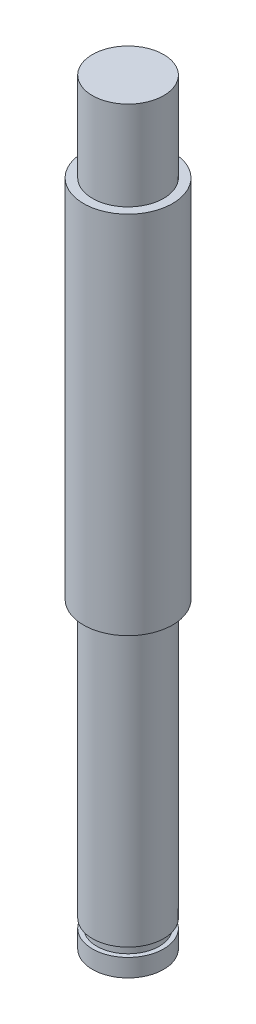
ISO-10303-21;
HEADER;
FILE_DESCRIPTION(('STEP AP214'),'2;1');
FILE_NAME('part.step','',(''),(''),'','','');
FILE_SCHEMA(('AUTOMOTIVE_DESIGN { 1 0 10303 214 1 1 1 1 }'));
ENDSEC;
DATA;
#1=APPLICATION_CONTEXT('core data for automotive mechanical design processes');
#2=APPLICATION_PROTOCOL_DEFINITION('international standard','automotive_design',2000,#1);
#3=PRODUCT_CONTEXT('',#1,'mechanical');
#4=PRODUCT('Part','Part','',(#3));
#5=PRODUCT_RELATED_PRODUCT_CATEGORY('part','',(#4));
#6=PRODUCT_DEFINITION_FORMATION('','',#4);
#7=PRODUCT_DEFINITION_CONTEXT('part definition',#1,'design');
#8=PRODUCT_DEFINITION('design','',#6,#7);
#9=PRODUCT_DEFINITION_SHAPE('','',#8);
#10=(LENGTH_UNIT() NAMED_UNIT(*) SI_UNIT(.MILLI.,.METRE.));
#11=(NAMED_UNIT(*) PLANE_ANGLE_UNIT() SI_UNIT($,.RADIAN.));
#12=(NAMED_UNIT(*) SI_UNIT($,.STERADIAN.) SOLID_ANGLE_UNIT());
#13=UNCERTAINTY_MEASURE_WITH_UNIT(LENGTH_MEASURE(1.E-05),#10,'distance_accuracy_value','');
#14=(GEOMETRIC_REPRESENTATION_CONTEXT(3) GLOBAL_UNCERTAINTY_ASSIGNED_CONTEXT((#13)) GLOBAL_UNIT_ASSIGNED_CONTEXT((#10,
#11,#12)) REPRESENTATION_CONTEXT('',''));
#15=CARTESIAN_POINT('',(0.,0.,0.));
#16=DIRECTION('',(0.,0.,1.));
#17=DIRECTION('',(1.,0.,0.));
#18=AXIS2_PLACEMENT_3D('',#15,#16,#17);
#19=CARTESIAN_POINT('',(0.,-34.,0.));
#20=DIRECTION('',(0.,-1.,0.));
#21=DIRECTION('',(0.,0.,-1.));
#22=AXIS2_PLACEMENT_3D('',#19,#20,#21);
#23=PLANE('',#22);
#24=CARTESIAN_POINT('',(0.,-34.,0.));
#25=DIRECTION('',(0.,-1.,0.));
#26=DIRECTION('',(0.,0.,-1.));
#27=AXIS2_PLACEMENT_3D('',#24,#25,#26);
#28=CIRCLE('',#27,4.);
#29=CARTESIAN_POINT('',(0.,-34.,-4.));
#30=VERTEX_POINT('',#29);
#31=EDGE_CURVE('E18',#30,#30,#28,.F.);
#32=ORIENTED_EDGE('',*,*,#31,.F.);
#33=EDGE_LOOP('',(#32));
#34=FACE_BOUND('',#33,.T.);
#35=ADVANCED_FACE('F15',(#34),#23,.T.);
#36=CARTESIAN_POINT('',(0.,0.,0.));
#37=DIRECTION('',(0.,-1.,0.));
#38=DIRECTION('',(0.,0.,-1.));
#39=AXIS2_PLACEMENT_3D('',#36,#37,#38);
#40=CYLINDRICAL_SURFACE('',#39,4.);
#41=ORIENTED_EDGE('',*,*,#31,.T.);
#42=EDGE_LOOP('',(#41));
#43=FACE_BOUND('',#42,.T.);
#44=CARTESIAN_POINT('',(0.,-32.,0.));
#45=DIRECTION('',(0.,-1.,0.));
#46=DIRECTION('',(0.,0.,-1.));
#47=AXIS2_PLACEMENT_3D('',#44,#45,#46);
#48=CIRCLE('',#47,4.);
#49=CARTESIAN_POINT('',(0.,-32.,-4.));
#50=VERTEX_POINT('',#49);
#51=EDGE_CURVE('E46',#50,#50,#48,.T.);
#52=ORIENTED_EDGE('',*,*,#51,.T.);
#53=EDGE_LOOP('',(#52));
#54=FACE_BOUND('',#53,.T.);
#55=ADVANCED_FACE('F53',(#43,#54),#40,.T.);
#56=CARTESIAN_POINT('',(0.,-32.,0.));
#57=DIRECTION('',(0.,-1.,0.));
#58=DIRECTION('',(0.,0.,-1.));
#59=AXIS2_PLACEMENT_3D('',#56,#57,#58);
#60=PLANE('',#59);
#61=CARTESIAN_POINT('',(0.,-32.,0.));
#62=DIRECTION('',(0.,-1.,0.));
#63=DIRECTION('',(0.,0.,-1.));
#64=AXIS2_PLACEMENT_3D('',#61,#62,#63);
#65=CIRCLE('',#64,3.5);
#66=CARTESIAN_POINT('',(0.,-32.,-3.5));
#67=VERTEX_POINT('',#66);
#68=EDGE_CURVE('E44',#67,#67,#65,.F.);
#69=ORIENTED_EDGE('',*,*,#68,.F.);
#70=EDGE_LOOP('',(#69));
#71=FACE_BOUND('',#70,.T.);
#72=ORIENTED_EDGE('',*,*,#51,.F.);
#73=EDGE_LOOP('',(#72));
#74=FACE_BOUND('',#73,.T.);
#75=ADVANCED_FACE('F60',(#71,#74),#60,.F.);
#76=CARTESIAN_POINT('',(0.,0.,0.));
#77=DIRECTION('',(0.,-1.,0.));
#78=DIRECTION('',(0.,0.,-1.));
#79=AXIS2_PLACEMENT_3D('',#76,#77,#78);
#80=CYLINDRICAL_SURFACE('',#79,3.5);
#81=CARTESIAN_POINT('',(0.,-31.,0.));
#82=DIRECTION('',(0.,-1.,0.));
#83=DIRECTION('',(0.,0.,-1.));
#84=AXIS2_PLACEMENT_3D('',#81,#82,#83);
#85=CIRCLE('',#84,3.5);
#86=CARTESIAN_POINT('',(0.,-31.,-3.5));
#87=VERTEX_POINT('',#86);
#88=EDGE_CURVE('E41',#87,#87,#85,.F.);
#89=ORIENTED_EDGE('',*,*,#88,.F.);
#90=EDGE_LOOP('',(#89));
#91=FACE_BOUND('',#90,.T.);
#92=ORIENTED_EDGE('',*,*,#68,.T.);
#93=EDGE_LOOP('',(#92));
#94=FACE_BOUND('',#93,.T.);
#95=ADVANCED_FACE('F92',(#91,#94),#80,.T.);
#96=CARTESIAN_POINT('',(0.,51.,0.));
#97=DIRECTION('',(0.,-1.,0.));
#98=DIRECTION('',(0.,0.,-1.));
#99=AXIS2_PLACEMENT_3D('',#96,#97,#98);
#100=PLANE('',#99);
#101=CARTESIAN_POINT('',(0.,51.,0.));
#102=DIRECTION('',(0.,-1.,0.));
#103=DIRECTION('',(0.,0.,-1.));
#104=AXIS2_PLACEMENT_3D('',#101,#102,#103);
#105=CIRCLE('',#104,4.);
#106=CARTESIAN_POINT('',(0.,51.,-4.));
#107=VERTEX_POINT('',#106);
#108=EDGE_CURVE('E38',#107,#107,#105,.T.);
#109=ORIENTED_EDGE('',*,*,#108,.F.);
#110=EDGE_LOOP('',(#109));
#111=FACE_BOUND('',#110,.T.);
#112=ADVANCED_FACE('F88',(#111),#100,.F.);
#113=CARTESIAN_POINT('',(0.,-31.,0.));
#114=DIRECTION('',(0.,-1.,0.));
#115=DIRECTION('',(0.,0.,-1.));
#116=AXIS2_PLACEMENT_3D('',#113,#114,#115);
#117=PLANE('',#116);
#118=ORIENTED_EDGE('',*,*,#88,.T.);
#119=EDGE_LOOP('',(#118));
#120=FACE_BOUND('',#119,.T.);
#121=CARTESIAN_POINT('',(0.,-31.,0.));
#122=DIRECTION('',(0.,-1.,0.));
#123=DIRECTION('',(0.,0.,-1.));
#124=AXIS2_PLACEMENT_3D('',#121,#122,#123);
#125=CIRCLE('',#124,4.);
#126=CARTESIAN_POINT('',(0.,-31.,-4.));
#127=VERTEX_POINT('',#126);
#128=EDGE_CURVE('E35',#127,#127,#125,.F.);
#129=ORIENTED_EDGE('',*,*,#128,.F.);
#130=EDGE_LOOP('',(#129));
#131=FACE_BOUND('',#130,.T.);
#132=ADVANCED_FACE('F84',(#120,#131),#117,.T.);
#133=CARTESIAN_POINT('',(0.,0.,0.));
#134=DIRECTION('',(0.,-1.,0.));
#135=DIRECTION('',(0.,0.,-1.));
#136=AXIS2_PLACEMENT_3D('',#133,#134,#135);
#137=CYLINDRICAL_SURFACE('',#136,4.);
#138=ORIENTED_EDGE('',*,*,#108,.T.);
#139=EDGE_LOOP('',(#138));
#140=FACE_BOUND('',#139,.T.);
#141=CARTESIAN_POINT('',(0.,41.,0.));
#142=DIRECTION('',(0.,-1.,0.));
#143=DIRECTION('',(0.,0.,-1.));
#144=AXIS2_PLACEMENT_3D('',#141,#142,#143);
#145=CIRCLE('',#144,4.);
#146=CARTESIAN_POINT('',(0.,41.,-4.));
#147=VERTEX_POINT('',#146);
#148=EDGE_CURVE('E32',#147,#147,#145,.F.);
#149=ORIENTED_EDGE('',*,*,#148,.T.);
#150=EDGE_LOOP('',(#149));
#151=FACE_BOUND('',#150,.T.);
#152=ADVANCED_FACE('F80',(#140,#151),#137,.T.);
#153=CARTESIAN_POINT('',(0.,0.,0.));
#154=DIRECTION('',(0.,-1.,0.));
#155=DIRECTION('',(0.,0.,-1.));
#156=AXIS2_PLACEMENT_3D('',#153,#154,#155);
#157=CYLINDRICAL_SURFACE('',#156,4.);
#158=CARTESIAN_POINT('',(0.,0.,0.));
#159=DIRECTION('',(0.,-1.,0.));
#160=DIRECTION('',(0.,0.,-1.));
#161=AXIS2_PLACEMENT_3D('',#158,#159,#160);
#162=CIRCLE('',#161,4.);
#163=CARTESIAN_POINT('',(0.,0.,-4.));
#164=VERTEX_POINT('',#163);
#165=EDGE_CURVE('E27',#164,#164,#162,.F.);
#166=ORIENTED_EDGE('',*,*,#165,.F.);
#167=EDGE_LOOP('',(#166));
#168=FACE_BOUND('',#167,.T.);
#169=ORIENTED_EDGE('',*,*,#128,.T.);
#170=EDGE_LOOP('',(#169));
#171=FACE_BOUND('',#170,.T.);
#172=ADVANCED_FACE('F76',(#168,#171),#157,.T.);
#173=CARTESIAN_POINT('',(0.,41.,0.));
#174=DIRECTION('',(0.,-1.,0.));
#175=DIRECTION('',(0.,0.,-1.));
#176=AXIS2_PLACEMENT_3D('',#173,#174,#175);
#177=PLANE('',#176);
#178=ORIENTED_EDGE('',*,*,#148,.F.);
#179=EDGE_LOOP('',(#178));
#180=FACE_BOUND('',#179,.T.);
#181=CARTESIAN_POINT('',(0.,41.,0.));
#182=DIRECTION('',(0.,-1.,0.));
#183=DIRECTION('',(0.,0.,-1.));
#184=AXIS2_PLACEMENT_3D('',#181,#182,#183);
#185=CIRCLE('',#184,5.);
#186=CARTESIAN_POINT('',(0.,41.,-5.));
#187=VERTEX_POINT('',#186);
#188=EDGE_CURVE('E22',#187,#187,#185,.T.);
#189=ORIENTED_EDGE('',*,*,#188,.F.);
#190=EDGE_LOOP('',(#189));
#191=FACE_BOUND('',#190,.T.);
#192=ADVANCED_FACE('F69',(#180,#191),#177,.F.);
#193=CARTESIAN_POINT('',(0.,0.,0.));
#194=DIRECTION('',(0.,-1.,0.));
#195=DIRECTION('',(0.,0.,-1.));
#196=AXIS2_PLACEMENT_3D('',#193,#194,#195);
#197=PLANE('',#196);
#198=ORIENTED_EDGE('',*,*,#165,.T.);
#199=EDGE_LOOP('',(#198));
#200=FACE_BOUND('',#199,.T.);
#201=CARTESIAN_POINT('',(0.,0.,0.));
#202=DIRECTION('',(0.,-1.,0.));
#203=DIRECTION('',(0.,0.,-1.));
#204=AXIS2_PLACEMENT_3D('',#201,#202,#203);
#205=CIRCLE('',#204,5.);
#206=CARTESIAN_POINT('',(0.,0.,-5.));
#207=VERTEX_POINT('',#206);
#208=EDGE_CURVE('E10',#207,#207,#205,.F.);
#209=ORIENTED_EDGE('',*,*,#208,.F.);
#210=EDGE_LOOP('',(#209));
#211=FACE_BOUND('',#210,.T.);
#212=ADVANCED_FACE('F63',(#200,#211),#197,.T.);
#213=CARTESIAN_POINT('',(0.,0.,0.));
#214=DIRECTION('',(0.,-1.,0.));
#215=DIRECTION('',(0.,0.,-1.));
#216=AXIS2_PLACEMENT_3D('',#213,#214,#215);
#217=CYLINDRICAL_SURFACE('',#216,5.);
#218=ORIENTED_EDGE('',*,*,#208,.T.);
#219=EDGE_LOOP('',(#218));
#220=FACE_BOUND('',#219,.T.);
#221=ORIENTED_EDGE('',*,*,#188,.T.);
#222=EDGE_LOOP('',(#221));
#223=FACE_BOUND('',#222,.T.);
#224=ADVANCED_FACE('F61',(#220,#223),#217,.T.);
#225=CLOSED_SHELL('',(#35,#55,#75,#95,#112,#132,#152,#172,#192,#212,#224));
#226=MANIFOLD_SOLID_BREP('B1',#225);
#227=ADVANCED_BREP_SHAPE_REPRESENTATION('',(#18,#226),#14);
#228=SHAPE_DEFINITION_REPRESENTATION(#9,#227);
ENDSEC;
END-ISO-10303-21;
